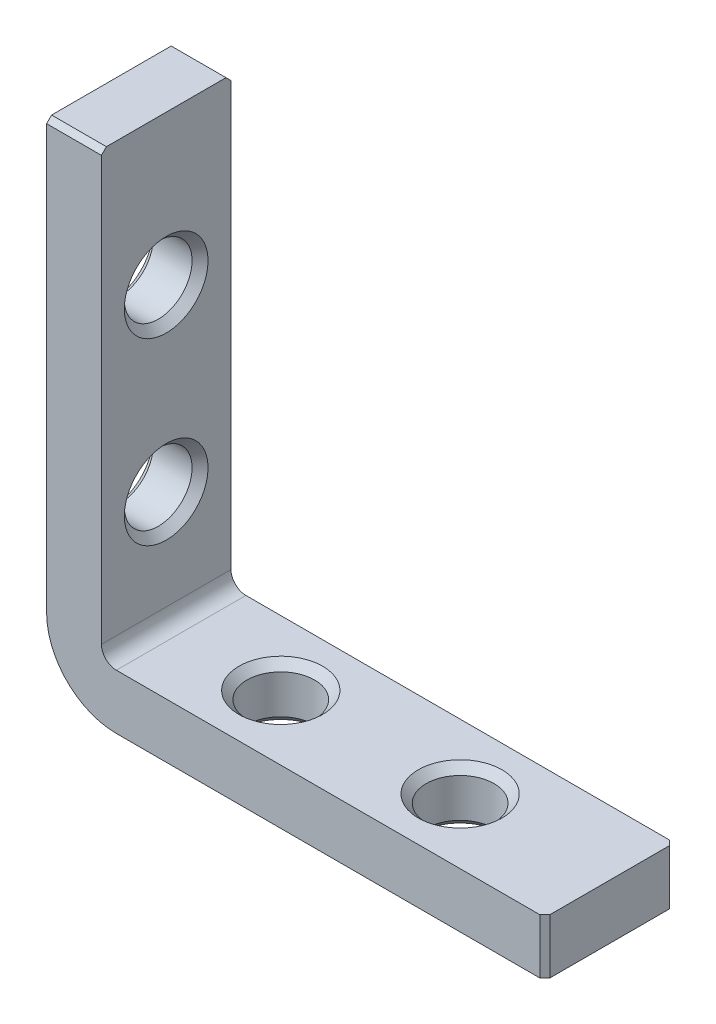
ISO-10303-21;
HEADER;
FILE_DESCRIPTION(('STEP AP214'),'2;1');
FILE_NAME('part.step','',(''),(''),'','','');
FILE_SCHEMA(('AUTOMOTIVE_DESIGN { 1 0 10303 214 1 1 1 1 }'));
ENDSEC;
DATA;
#1=APPLICATION_CONTEXT('core data for automotive mechanical design processes');
#2=APPLICATION_PROTOCOL_DEFINITION('international standard','automotive_design',2000,#1);
#3=PRODUCT_CONTEXT('',#1,'mechanical');
#4=PRODUCT('Part','Part','',(#3));
#5=PRODUCT_RELATED_PRODUCT_CATEGORY('part','',(#4));
#6=PRODUCT_DEFINITION_FORMATION('','',#4);
#7=PRODUCT_DEFINITION_CONTEXT('part definition',#1,'design');
#8=PRODUCT_DEFINITION('design','',#6,#7);
#9=PRODUCT_DEFINITION_SHAPE('','',#8);
#10=(LENGTH_UNIT() NAMED_UNIT(*) SI_UNIT(.MILLI.,.METRE.));
#11=(NAMED_UNIT(*) PLANE_ANGLE_UNIT() SI_UNIT($,.RADIAN.));
#12=(NAMED_UNIT(*) SI_UNIT($,.STERADIAN.) SOLID_ANGLE_UNIT());
#13=UNCERTAINTY_MEASURE_WITH_UNIT(LENGTH_MEASURE(1.E-05),#10,'distance_accuracy_value','');
#14=(GEOMETRIC_REPRESENTATION_CONTEXT(3) GLOBAL_UNCERTAINTY_ASSIGNED_CONTEXT((#13)) GLOBAL_UNIT_ASSIGNED_CONTEXT((#10,
#11,#12)) REPRESENTATION_CONTEXT('',''));
#15=CARTESIAN_POINT('',(0.,0.,0.));
#16=DIRECTION('',(0.,0.,1.));
#17=DIRECTION('',(1.,0.,0.));
#18=AXIS2_PLACEMENT_3D('',#15,#16,#17);
#19=CARTESIAN_POINT('',(5.50000000000001,50.,6.5));
#20=DIRECTION('',(0.,-1.,0.));
#21=DIRECTION('',(0.,0.,-1.));
#22=AXIS2_PLACEMENT_3D('',#19,#20,#21);
#23=PLANE('',#22);
#24=DIRECTION('',(0.,0.,-1.));
#25=VECTOR('',#24,1.);
#26=CARTESIAN_POINT('',(5.50000000000001,50.,6.5));
#27=LINE('',#26,#25);
#28=CARTESIAN_POINT('',(5.50000000000001,50.,6.));
#29=VERTEX_POINT('',#28);
#30=CARTESIAN_POINT('',(5.50000000000001,50.,-6.));
#31=VERTEX_POINT('',#30);
#32=EDGE_CURVE('E167',#29,#31,#27,.T.);
#33=ORIENTED_EDGE('',*,*,#32,.T.);
#34=DIRECTION('',(-1.,0.,0.));
#35=VECTOR('',#34,1.);
#36=CARTESIAN_POINT('',(5.50000000000001,50.,-6.));
#37=LINE('',#36,#35);
#38=CARTESIAN_POINT('',(0.,50.,-6.));
#39=VERTEX_POINT('',#38);
#40=EDGE_CURVE('E217',#31,#39,#37,.T.);
#41=ORIENTED_EDGE('',*,*,#40,.T.);
#42=DIRECTION('',(0.,0.,-1.));
#43=VECTOR('',#42,1.);
#44=CARTESIAN_POINT('',(0.,50.,6.5));
#45=LINE('',#44,#43);
#46=CARTESIAN_POINT('',(0.,50.,6.));
#47=VERTEX_POINT('',#46);
#48=EDGE_CURVE('E150',#47,#39,#45,.T.);
#49=ORIENTED_EDGE('',*,*,#48,.F.);
#50=DIRECTION('',(1.,0.,0.));
#51=VECTOR('',#50,1.);
#52=CARTESIAN_POINT('',(5.50000000000001,50.,6.));
#53=LINE('',#52,#51);
#54=EDGE_CURVE('E60',#47,#29,#53,.T.);
#55=ORIENTED_EDGE('',*,*,#54,.T.);
#56=EDGE_LOOP('',(#33,#41,#49,#55));
#57=FACE_BOUND('',#56,.T.);
#58=ADVANCED_FACE('F39',(#57),#23,.F.);
#59=CARTESIAN_POINT('',(0.,50.,6.5));
#60=DIRECTION('',(1.,0.,0.));
#61=DIRECTION('',(0.,0.,-1.));
#62=AXIS2_PLACEMENT_3D('',#59,#60,#61);
#63=PLANE('',#62);
#64=CARTESIAN_POINT('',(0.,35.,0.));
#65=DIRECTION('',(-1.,0.,0.));
#66=DIRECTION('',(0.,0.,1.));
#67=AXIS2_PLACEMENT_3D('',#64,#65,#66);
#68=CIRCLE('',#67,4.2);
#69=CARTESIAN_POINT('',(0.,35.,4.2));
#70=VERTEX_POINT('',#69);
#71=EDGE_CURVE('E529',#70,#70,#68,.T.);
#72=ORIENTED_EDGE('',*,*,#71,.F.);
#73=EDGE_LOOP('',(#72));
#74=FACE_BOUND('',#73,.T.);
#75=CARTESIAN_POINT('',(0.,17.,0.));
#76=DIRECTION('',(-1.,0.,0.));
#77=DIRECTION('',(0.,0.,1.));
#78=AXIS2_PLACEMENT_3D('',#75,#76,#77);
#79=CIRCLE('',#78,4.2);
#80=CARTESIAN_POINT('',(0.,17.,4.2));
#81=VERTEX_POINT('',#80);
#82=EDGE_CURVE('E517',#81,#81,#79,.T.);
#83=ORIENTED_EDGE('',*,*,#82,.F.);
#84=EDGE_LOOP('',(#83));
#85=FACE_BOUND('',#84,.T.);
#86=ORIENTED_EDGE('',*,*,#48,.T.);
#87=DIRECTION('',(0.,0.707106781186543,0.707106781186552));
#88=VECTOR('',#87,1.);
#89=CARTESIAN_POINT('',(0.,50.,-6.));
#90=LINE('',#89,#88);
#91=CARTESIAN_POINT('',(0.,49.5,-6.5));
#92=VERTEX_POINT('',#91);
#93=EDGE_CURVE('E222',#39,#92,#90,.F.);
#94=ORIENTED_EDGE('',*,*,#93,.T.);
#95=DIRECTION('',(0.,-1.,0.));
#96=VECTOR('',#95,1.);
#97=CARTESIAN_POINT('',(0.,50.,-6.5));
#98=LINE('',#97,#96);
#99=CARTESIAN_POINT('',(0.,7.00000000000005,-6.5));
#100=VERTEX_POINT('',#99);
#101=EDGE_CURVE('E147',#92,#100,#98,.T.);
#102=ORIENTED_EDGE('',*,*,#101,.T.);
#103=DIRECTION('',(0.,0.,-1.));
#104=VECTOR('',#103,1.);
#105=CARTESIAN_POINT('',(0.,7.00000000000005,6.5));
#106=LINE('',#105,#104);
#107=CARTESIAN_POINT('',(0.,7.00000000000005,6.5));
#108=VERTEX_POINT('',#107);
#109=EDGE_CURVE('E143',#108,#100,#106,.T.);
#110=ORIENTED_EDGE('',*,*,#109,.F.);
#111=DIRECTION('',(0.,-1.,0.));
#112=VECTOR('',#111,1.);
#113=CARTESIAN_POINT('',(0.,50.,6.5));
#114=LINE('',#113,#112);
#115=CARTESIAN_POINT('',(0.,49.5,6.5));
#116=VERTEX_POINT('',#115);
#117=EDGE_CURVE('E129',#116,#108,#114,.T.);
#118=ORIENTED_EDGE('',*,*,#117,.F.);
#119=DIRECTION('',(0.,0.707106781186543,-0.707106781186552));
#120=VECTOR('',#119,1.);
#121=CARTESIAN_POINT('',(0.,49.5,6.5));
#122=LINE('',#121,#120);
#123=EDGE_CURVE('E220',#116,#47,#122,.T.);
#124=ORIENTED_EDGE('',*,*,#123,.T.);
#125=EDGE_LOOP('',(#86,#94,#102,#110,#118,#124));
#126=FACE_BOUND('',#125,.T.);
#127=ADVANCED_FACE('F145',(#74,#85,#126),#63,.F.);
#128=CARTESIAN_POINT('',(7.,7.,6.5));
#129=DIRECTION('',(0.,0.,-1.));
#130=DIRECTION('',(-1.,0.,0.));
#131=AXIS2_PLACEMENT_3D('',#128,#129,#130);
#132=CYLINDRICAL_SURFACE('',#131,7.);
#133=CARTESIAN_POINT('',(7.,7.,-6.5));
#134=DIRECTION('',(0.,0.,1.));
#135=DIRECTION('',(1.,0.,0.));
#136=AXIS2_PLACEMENT_3D('',#133,#134,#135);
#137=CIRCLE('',#136,7.);
#138=CARTESIAN_POINT('',(7.00000000000005,0.,-6.5));
#139=VERTEX_POINT('',#138);
#140=EDGE_CURVE('E169',#100,#139,#137,.T.);
#141=ORIENTED_EDGE('',*,*,#140,.T.);
#142=DIRECTION('',(0.,0.,-1.));
#143=VECTOR('',#142,1.);
#144=CARTESIAN_POINT('',(7.00000000000005,0.,6.5));
#145=LINE('',#144,#143);
#146=CARTESIAN_POINT('',(7.00000000000005,0.,6.5));
#147=VERTEX_POINT('',#146);
#148=EDGE_CURVE('E151',#147,#139,#145,.T.);
#149=ORIENTED_EDGE('',*,*,#148,.F.);
#150=CARTESIAN_POINT('',(7.,7.,6.5));
#151=DIRECTION('',(0.,0.,1.));
#152=DIRECTION('',(1.,0.,0.));
#153=AXIS2_PLACEMENT_3D('',#150,#151,#152);
#154=CIRCLE('',#153,7.);
#155=EDGE_CURVE('E134',#108,#147,#154,.T.);
#156=ORIENTED_EDGE('',*,*,#155,.F.);
#157=ORIENTED_EDGE('',*,*,#109,.T.);
#158=EDGE_LOOP('',(#141,#149,#156,#157));
#159=FACE_BOUND('',#158,.T.);
#160=ADVANCED_FACE('F153',(#159),#132,.T.);
#161=CARTESIAN_POINT('',(7.00000000000005,0.,6.5));
#162=DIRECTION('',(0.,1.,0.));
#163=DIRECTION('',(0.,0.,1.));
#164=AXIS2_PLACEMENT_3D('',#161,#162,#163);
#165=PLANE('',#164);
#166=CARTESIAN_POINT('',(35.,0.,0.));
#167=DIRECTION('',(0.,-1.,0.));
#168=DIRECTION('',(0.,0.,-1.));
#169=AXIS2_PLACEMENT_3D('',#166,#167,#168);
#170=CIRCLE('',#169,4.2);
#171=CARTESIAN_POINT('',(35.,0.,-4.2));
#172=VERTEX_POINT('',#171);
#173=EDGE_CURVE('E553',#172,#172,#170,.T.);
#174=ORIENTED_EDGE('',*,*,#173,.F.);
#175=EDGE_LOOP('',(#174));
#176=FACE_BOUND('',#175,.T.);
#177=CARTESIAN_POINT('',(17.,0.,0.));
#178=DIRECTION('',(0.,-1.,0.));
#179=DIRECTION('',(0.,0.,-1.));
#180=AXIS2_PLACEMENT_3D('',#177,#178,#179);
#181=CIRCLE('',#180,4.2);
#182=CARTESIAN_POINT('',(17.,0.,-4.2));
#183=VERTEX_POINT('',#182);
#184=EDGE_CURVE('E541',#183,#183,#181,.T.);
#185=ORIENTED_EDGE('',*,*,#184,.F.);
#186=EDGE_LOOP('',(#185));
#187=FACE_BOUND('',#186,.T.);
#188=DIRECTION('',(1.,0.,0.));
#189=VECTOR('',#188,1.);
#190=CARTESIAN_POINT('',(7.00000000000005,0.,-6.5));
#191=LINE('',#190,#189);
#192=CARTESIAN_POINT('',(49.5,0.,-6.5));
#193=VERTEX_POINT('',#192);
#194=EDGE_CURVE('E172',#139,#193,#191,.T.);
#195=ORIENTED_EDGE('',*,*,#194,.T.);
#196=DIRECTION('',(-0.707106781186543,0.,-0.707106781186552));
#197=VECTOR('',#196,1.);
#198=CARTESIAN_POINT('',(50.,0.,-6.));
#199=LINE('',#198,#197);
#200=CARTESIAN_POINT('',(50.,0.,-6.));
#201=VERTEX_POINT('',#200);
#202=EDGE_CURVE('E210',#193,#201,#199,.F.);
#203=ORIENTED_EDGE('',*,*,#202,.T.);
#204=DIRECTION('',(0.,0.,-1.));
#205=VECTOR('',#204,1.);
#206=CARTESIAN_POINT('',(50.,0.,6.5));
#207=LINE('',#206,#205);
#208=CARTESIAN_POINT('',(50.,0.,6.));
#209=VERTEX_POINT('',#208);
#210=EDGE_CURVE('E190',#209,#201,#207,.T.);
#211=ORIENTED_EDGE('',*,*,#210,.F.);
#212=DIRECTION('',(-0.707106781186543,0.,0.707106781186552));
#213=VECTOR('',#212,1.);
#214=CARTESIAN_POINT('',(49.5,0.,6.5));
#215=LINE('',#214,#213);
#216=CARTESIAN_POINT('',(49.5,0.,6.5));
#217=VERTEX_POINT('',#216);
#218=EDGE_CURVE('E208',#209,#217,#215,.T.);
#219=ORIENTED_EDGE('',*,*,#218,.T.);
#220=DIRECTION('',(1.,0.,0.));
#221=VECTOR('',#220,1.);
#222=CARTESIAN_POINT('',(7.00000000000005,0.,6.5));
#223=LINE('',#222,#221);
#224=EDGE_CURVE('E156',#147,#217,#223,.T.);
#225=ORIENTED_EDGE('',*,*,#224,.F.);
#226=ORIENTED_EDGE('',*,*,#148,.T.);
#227=EDGE_LOOP('',(#195,#203,#211,#219,#225,#226));
#228=FACE_BOUND('',#227,.T.);
#229=ADVANCED_FACE('F239',(#176,#187,#228),#165,.F.);
#230=CARTESIAN_POINT('',(50.,5.50000000000001,6.5));
#231=DIRECTION('',(-1.,0.,0.));
#232=DIRECTION('',(0.,0.,1.));
#233=AXIS2_PLACEMENT_3D('',#230,#231,#232);
#234=PLANE('',#233);
#235=ORIENTED_EDGE('',*,*,#210,.T.);
#236=DIRECTION('',(0.,1.,0.));
#237=VECTOR('',#236,1.);
#238=CARTESIAN_POINT('',(50.,5.50000000000001,-6.));
#239=LINE('',#238,#237);
#240=CARTESIAN_POINT('',(50.,5.50000000000001,-6.));
#241=VERTEX_POINT('',#240);
#242=EDGE_CURVE('E197',#201,#241,#239,.T.);
#243=ORIENTED_EDGE('',*,*,#242,.T.);
#244=DIRECTION('',(0.,0.,-1.));
#245=VECTOR('',#244,1.);
#246=CARTESIAN_POINT('',(50.,5.50000000000001,6.5));
#247=LINE('',#246,#245);
#248=CARTESIAN_POINT('',(50.,5.50000000000001,6.));
#249=VERTEX_POINT('',#248);
#250=EDGE_CURVE('E187',#249,#241,#247,.T.);
#251=ORIENTED_EDGE('',*,*,#250,.F.);
#252=DIRECTION('',(0.,-1.,0.));
#253=VECTOR('',#252,1.);
#254=CARTESIAN_POINT('',(50.,0.,6.));
#255=LINE('',#254,#253);
#256=EDGE_CURVE('E195',#249,#209,#255,.T.);
#257=ORIENTED_EDGE('',*,*,#256,.T.);
#258=EDGE_LOOP('',(#235,#243,#251,#257));
#259=FACE_BOUND('',#258,.T.);
#260=ADVANCED_FACE('F253',(#259),#234,.F.);
#261=CARTESIAN_POINT('',(50.,5.50000000000001,6.5));
#262=DIRECTION('',(0.,-1.,0.));
#263=DIRECTION('',(1.,0.,0.));
#264=AXIS2_PLACEMENT_3D('',#261,#262,#263);
#265=PLANE('',#264);
#266=CARTESIAN_POINT('',(35.,5.49999999999999,0.));
#267=DIRECTION('',(0.,-1.,0.));
#268=DIRECTION('',(0.,0.,-1.));
#269=AXIS2_PLACEMENT_3D('',#266,#267,#268);
#270=CIRCLE('',#269,4.2);
#271=CARTESIAN_POINT('',(35.,5.49999999999999,-4.2));
#272=VERTEX_POINT('',#271);
#273=EDGE_CURVE('E556',#272,#272,#270,.T.);
#274=ORIENTED_EDGE('',*,*,#273,.T.);
#275=EDGE_LOOP('',(#274));
#276=FACE_BOUND('',#275,.T.);
#277=CARTESIAN_POINT('',(17.,5.49999999999999,0.));
#278=DIRECTION('',(0.,-1.,0.));
#279=DIRECTION('',(0.,0.,-1.));
#280=AXIS2_PLACEMENT_3D('',#277,#278,#279);
#281=CIRCLE('',#280,4.2);
#282=CARTESIAN_POINT('',(17.,5.49999999999999,-4.2));
#283=VERTEX_POINT('',#282);
#284=EDGE_CURVE('E544',#283,#283,#281,.T.);
#285=ORIENTED_EDGE('',*,*,#284,.T.);
#286=EDGE_LOOP('',(#285));
#287=FACE_BOUND('',#286,.T.);
#288=ORIENTED_EDGE('',*,*,#250,.T.);
#289=DIRECTION('',(0.707106781186543,0.,0.707106781186552));
#290=VECTOR('',#289,1.);
#291=CARTESIAN_POINT('',(50.,5.50000000000001,-6.));
#292=LINE('',#291,#290);
#293=CARTESIAN_POINT('',(49.5,5.50000000000001,-6.5));
#294=VERTEX_POINT('',#293);
#295=EDGE_CURVE('E202',#241,#294,#292,.F.);
#296=ORIENTED_EDGE('',*,*,#295,.T.);
#297=DIRECTION('',(-1.,0.,0.));
#298=VECTOR('',#297,1.);
#299=CARTESIAN_POINT('',(50.,5.50000000000001,-6.5));
#300=LINE('',#299,#298);
#301=CARTESIAN_POINT('',(7.00000000000002,5.5,-6.5));
#302=VERTEX_POINT('',#301);
#303=EDGE_CURVE('E175',#294,#302,#300,.T.);
#304=ORIENTED_EDGE('',*,*,#303,.T.);
#305=DIRECTION('',(0.,0.,-1.));
#306=VECTOR('',#305,1.);
#307=CARTESIAN_POINT('',(7.00000000000002,5.5,6.5));
#308=LINE('',#307,#306);
#309=CARTESIAN_POINT('',(7.00000000000002,5.5,6.5));
#310=VERTEX_POINT('',#309);
#311=EDGE_CURVE('E184',#310,#302,#308,.T.);
#312=ORIENTED_EDGE('',*,*,#311,.F.);
#313=DIRECTION('',(-1.,0.,0.));
#314=VECTOR('',#313,1.);
#315=CARTESIAN_POINT('',(50.,5.50000000000001,6.5));
#316=LINE('',#315,#314);
#317=CARTESIAN_POINT('',(49.5,5.50000000000001,6.5));
#318=VERTEX_POINT('',#317);
#319=EDGE_CURVE('E158',#318,#310,#316,.T.);
#320=ORIENTED_EDGE('',*,*,#319,.F.);
#321=DIRECTION('',(0.707106781186543,0.,-0.707106781186552));
#322=VECTOR('',#321,1.);
#323=CARTESIAN_POINT('',(49.5,5.50000000000001,6.5));
#324=LINE('',#323,#322);
#325=EDGE_CURVE('E200',#318,#249,#324,.T.);
#326=ORIENTED_EDGE('',*,*,#325,.T.);
#327=EDGE_LOOP('',(#288,#296,#304,#312,#320,#326));
#328=FACE_BOUND('',#327,.T.);
#329=ADVANCED_FACE('F250',(#276,#287,#328),#265,.F.);
#330=CARTESIAN_POINT('',(7.,7.,6.5));
#331=DIRECTION('',(0.,0.,-1.));
#332=DIRECTION('',(-1.,0.,0.));
#333=AXIS2_PLACEMENT_3D('',#330,#331,#332);
#334=CYLINDRICAL_SURFACE('',#333,1.5);
#335=CARTESIAN_POINT('',(7.,7.,-6.5));
#336=DIRECTION('',(0.,0.,-1.));
#337=DIRECTION('',(-1.,0.,0.));
#338=AXIS2_PLACEMENT_3D('',#335,#336,#337);
#339=CIRCLE('',#338,1.5);
#340=CARTESIAN_POINT('',(5.50000000000001,7.,-6.5));
#341=VERTEX_POINT('',#340);
#342=EDGE_CURVE('E177',#302,#341,#339,.T.);
#343=ORIENTED_EDGE('',*,*,#342,.T.);
#344=DIRECTION('',(0.,0.,-1.));
#345=VECTOR('',#344,1.);
#346=CARTESIAN_POINT('',(5.50000000000001,7.,6.5));
#347=LINE('',#346,#345);
#348=CARTESIAN_POINT('',(5.50000000000001,7.,6.5));
#349=VERTEX_POINT('',#348);
#350=EDGE_CURVE('E181',#349,#341,#347,.T.);
#351=ORIENTED_EDGE('',*,*,#350,.F.);
#352=CARTESIAN_POINT('',(7.,7.,6.5));
#353=DIRECTION('',(0.,0.,-1.));
#354=DIRECTION('',(-1.,0.,0.));
#355=AXIS2_PLACEMENT_3D('',#352,#353,#354);
#356=CIRCLE('',#355,1.5);
#357=EDGE_CURVE('E163',#310,#349,#356,.T.);
#358=ORIENTED_EDGE('',*,*,#357,.F.);
#359=ORIENTED_EDGE('',*,*,#311,.T.);
#360=EDGE_LOOP('',(#343,#351,#358,#359));
#361=FACE_BOUND('',#360,.T.);
#362=ADVANCED_FACE('F260',(#361),#334,.F.);
#363=CARTESIAN_POINT('',(5.50000000000001,7.00000000000001,6.5));
#364=DIRECTION('',(-1.,0.,0.));
#365=DIRECTION('',(0.,0.,1.));
#366=AXIS2_PLACEMENT_3D('',#363,#364,#365);
#367=PLANE('',#366);
#368=CARTESIAN_POINT('',(5.5,35.,0.));
#369=DIRECTION('',(-1.,0.,0.));
#370=DIRECTION('',(0.,0.,1.));
#371=AXIS2_PLACEMENT_3D('',#368,#369,#370);
#372=CIRCLE('',#371,4.2);
#373=CARTESIAN_POINT('',(5.5,35.,4.2));
#374=VERTEX_POINT('',#373);
#375=EDGE_CURVE('E532',#374,#374,#372,.T.);
#376=ORIENTED_EDGE('',*,*,#375,.T.);
#377=EDGE_LOOP('',(#376));
#378=FACE_BOUND('',#377,.T.);
#379=CARTESIAN_POINT('',(5.5,17.,0.));
#380=DIRECTION('',(-1.,0.,0.));
#381=DIRECTION('',(0.,0.,1.));
#382=AXIS2_PLACEMENT_3D('',#379,#380,#381);
#383=CIRCLE('',#382,4.2);
#384=CARTESIAN_POINT('',(5.5,17.,4.2));
#385=VERTEX_POINT('',#384);
#386=EDGE_CURVE('E512',#385,#385,#383,.T.);
#387=ORIENTED_EDGE('',*,*,#386,.T.);
#388=EDGE_LOOP('',(#387));
#389=FACE_BOUND('',#388,.T.);
#390=DIRECTION('',(0.,1.,0.));
#391=VECTOR('',#390,1.);
#392=CARTESIAN_POINT('',(5.50000000000001,7.00000000000001,-6.5));
#393=LINE('',#392,#391);
#394=CARTESIAN_POINT('',(5.50000000000001,49.5,-6.5));
#395=VERTEX_POINT('',#394);
#396=EDGE_CURVE('E140',#341,#395,#393,.T.);
#397=ORIENTED_EDGE('',*,*,#396,.T.);
#398=DIRECTION('',(0.,-0.707106781186543,-0.707106781186552));
#399=VECTOR('',#398,1.);
#400=CARTESIAN_POINT('',(5.50000000000001,50.,-6.));
#401=LINE('',#400,#399);
#402=EDGE_CURVE('E11',#395,#31,#401,.F.);
#403=ORIENTED_EDGE('',*,*,#402,.T.);
#404=ORIENTED_EDGE('',*,*,#32,.F.);
#405=DIRECTION('',(0.,-0.707106781186543,0.707106781186552));
#406=VECTOR('',#405,1.);
#407=CARTESIAN_POINT('',(5.50000000000001,49.5,6.5));
#408=LINE('',#407,#406);
#409=CARTESIAN_POINT('',(5.50000000000001,49.5,6.5));
#410=VERTEX_POINT('',#409);
#411=EDGE_CURVE('E48',#29,#410,#408,.T.);
#412=ORIENTED_EDGE('',*,*,#411,.T.);
#413=DIRECTION('',(0.,1.,0.));
#414=VECTOR('',#413,1.);
#415=CARTESIAN_POINT('',(5.50000000000001,7.00000000000001,6.5));
#416=LINE('',#415,#414);
#417=EDGE_CURVE('E165',#349,#410,#416,.T.);
#418=ORIENTED_EDGE('',*,*,#417,.F.);
#419=ORIENTED_EDGE('',*,*,#350,.T.);
#420=EDGE_LOOP('',(#397,#403,#404,#412,#418,#419));
#421=FACE_BOUND('',#420,.T.);
#422=ADVANCED_FACE('F225',(#378,#389,#421),#367,.F.);
#423=CARTESIAN_POINT('',(7.,7.,6.5));
#424=DIRECTION('',(0.,0.,1.));
#425=DIRECTION('',(1.,0.,0.));
#426=AXIS2_PLACEMENT_3D('',#423,#424,#425);
#427=PLANE('',#426);
#428=ORIENTED_EDGE('',*,*,#224,.T.);
#429=DIRECTION('',(0.,1.,0.));
#430=VECTOR('',#429,1.);
#431=CARTESIAN_POINT('',(49.5,5.50000000000001,6.5));
#432=LINE('',#431,#430);
#433=EDGE_CURVE('E213',#217,#318,#432,.T.);
#434=ORIENTED_EDGE('',*,*,#433,.T.);
#435=ORIENTED_EDGE('',*,*,#319,.T.);
#436=ORIENTED_EDGE('',*,*,#357,.T.);
#437=ORIENTED_EDGE('',*,*,#417,.T.);
#438=DIRECTION('',(-1.,0.,0.));
#439=VECTOR('',#438,1.);
#440=CARTESIAN_POINT('',(0.,49.5,6.5));
#441=LINE('',#440,#439);
#442=EDGE_CURVE('E138',#410,#116,#441,.T.);
#443=ORIENTED_EDGE('',*,*,#442,.T.);
#444=ORIENTED_EDGE('',*,*,#117,.T.);
#445=ORIENTED_EDGE('',*,*,#155,.T.);
#446=EDGE_LOOP('',(#428,#434,#435,#436,#437,#443,#444,#445));
#447=FACE_BOUND('',#446,.T.);
#448=ADVANCED_FACE('F132',(#447),#427,.T.);
#449=CARTESIAN_POINT('',(7.,7.,-6.5));
#450=DIRECTION('',(0.,0.,1.));
#451=DIRECTION('',(1.,0.,0.));
#452=AXIS2_PLACEMENT_3D('',#449,#450,#451);
#453=PLANE('',#452);
#454=ORIENTED_EDGE('',*,*,#303,.F.);
#455=DIRECTION('',(0.,-1.,0.));
#456=VECTOR('',#455,1.);
#457=CARTESIAN_POINT('',(49.5,7.,-6.5));
#458=LINE('',#457,#456);
#459=EDGE_CURVE('E206',#294,#193,#458,.T.);
#460=ORIENTED_EDGE('',*,*,#459,.T.);
#461=ORIENTED_EDGE('',*,*,#194,.F.);
#462=ORIENTED_EDGE('',*,*,#140,.F.);
#463=ORIENTED_EDGE('',*,*,#101,.F.);
#464=DIRECTION('',(1.,0.,0.));
#465=VECTOR('',#464,1.);
#466=CARTESIAN_POINT('',(7.,49.5,-6.5));
#467=LINE('',#466,#465);
#468=EDGE_CURVE('E204',#92,#395,#467,.T.);
#469=ORIENTED_EDGE('',*,*,#468,.T.);
#470=ORIENTED_EDGE('',*,*,#396,.F.);
#471=ORIENTED_EDGE('',*,*,#342,.F.);
#472=EDGE_LOOP('',(#454,#460,#461,#462,#463,#469,#470,#471));
#473=FACE_BOUND('',#472,.T.);
#474=ADVANCED_FACE('F235',(#473),#453,.F.);
#475=CARTESIAN_POINT('',(4.7,17.,0.));
#476=DIRECTION('',(1.,0.,0.));
#477=DIRECTION('',(0.,0.,-1.));
#478=AXIS2_PLACEMENT_3D('',#475,#476,#477);
#479=CONICAL_SURFACE('',#478,3.4,0.785398163397445);
#480=ORIENTED_EDGE('',*,*,#386,.F.);
#481=EDGE_LOOP('',(#480));
#482=FACE_BOUND('',#481,.T.);
#483=CARTESIAN_POINT('',(4.7,17.,0.));
#484=DIRECTION('',(-1.,0.,0.));
#485=DIRECTION('',(0.,0.,1.));
#486=AXIS2_PLACEMENT_3D('',#483,#484,#485);
#487=CIRCLE('',#486,3.4);
#488=CARTESIAN_POINT('',(4.7,17.,3.4));
#489=VERTEX_POINT('',#488);
#490=EDGE_CURVE('E170',#489,#489,#487,.T.);
#491=ORIENTED_EDGE('',*,*,#490,.T.);
#492=EDGE_LOOP('',(#491));
#493=FACE_BOUND('',#492,.T.);
#494=ADVANCED_FACE('F326',(#482,#493),#479,.F.);
#495=CARTESIAN_POINT('',(0.,17.,0.));
#496=DIRECTION('',(-1.,0.,0.));
#497=DIRECTION('',(0.,0.,1.));
#498=AXIS2_PLACEMENT_3D('',#495,#496,#497);
#499=CYLINDRICAL_SURFACE('',#498,3.4);
#500=ORIENTED_EDGE('',*,*,#490,.F.);
#501=EDGE_LOOP('',(#500));
#502=FACE_BOUND('',#501,.T.);
#503=CARTESIAN_POINT('',(0.8,17.,0.));
#504=DIRECTION('',(-1.,0.,0.));
#505=DIRECTION('',(0.,0.,1.));
#506=AXIS2_PLACEMENT_3D('',#503,#504,#505);
#507=CIRCLE('',#506,3.4);
#508=CARTESIAN_POINT('',(0.8,17.,3.4));
#509=VERTEX_POINT('',#508);
#510=EDGE_CURVE('E515',#509,#509,#507,.T.);
#511=ORIENTED_EDGE('',*,*,#510,.T.);
#512=EDGE_LOOP('',(#511));
#513=FACE_BOUND('',#512,.T.);
#514=ADVANCED_FACE('F479',(#502,#513),#499,.F.);
#515=CARTESIAN_POINT('',(0.,17.,0.));
#516=DIRECTION('',(-1.,0.,0.));
#517=DIRECTION('',(0.,0.,1.));
#518=AXIS2_PLACEMENT_3D('',#515,#516,#517);
#519=CONICAL_SURFACE('',#518,4.2,0.785398163397447);
#520=ORIENTED_EDGE('',*,*,#510,.F.);
#521=EDGE_LOOP('',(#520));
#522=FACE_BOUND('',#521,.T.);
#523=ORIENTED_EDGE('',*,*,#82,.T.);
#524=EDGE_LOOP('',(#523));
#525=FACE_BOUND('',#524,.T.);
#526=ADVANCED_FACE('F469',(#522,#525),#519,.F.);
#527=CARTESIAN_POINT('',(4.7,35.,0.));
#528=DIRECTION('',(1.,0.,0.));
#529=DIRECTION('',(0.,0.,-1.));
#530=AXIS2_PLACEMENT_3D('',#527,#528,#529);
#531=CONICAL_SURFACE('',#530,3.4,0.785398163397447);
#532=ORIENTED_EDGE('',*,*,#375,.F.);
#533=EDGE_LOOP('',(#532));
#534=FACE_BOUND('',#533,.T.);
#535=CARTESIAN_POINT('',(4.7,35.,0.));
#536=DIRECTION('',(-1.,0.,0.));
#537=DIRECTION('',(0.,0.,1.));
#538=AXIS2_PLACEMENT_3D('',#535,#536,#537);
#539=CIRCLE('',#538,3.4);
#540=CARTESIAN_POINT('',(4.7,35.,3.4));
#541=VERTEX_POINT('',#540);
#542=EDGE_CURVE('E523',#541,#541,#539,.T.);
#543=ORIENTED_EDGE('',*,*,#542,.T.);
#544=EDGE_LOOP('',(#543));
#545=FACE_BOUND('',#544,.T.);
#546=ADVANCED_FACE('F459',(#534,#545),#531,.F.);
#547=CARTESIAN_POINT('',(0.,35.,0.));
#548=DIRECTION('',(-1.,0.,0.));
#549=DIRECTION('',(0.,0.,1.));
#550=AXIS2_PLACEMENT_3D('',#547,#548,#549);
#551=CYLINDRICAL_SURFACE('',#550,3.4);
#552=ORIENTED_EDGE('',*,*,#542,.F.);
#553=EDGE_LOOP('',(#552));
#554=FACE_BOUND('',#553,.T.);
#555=CARTESIAN_POINT('',(0.8,35.,0.));
#556=DIRECTION('',(-1.,0.,0.));
#557=DIRECTION('',(0.,0.,1.));
#558=AXIS2_PLACEMENT_3D('',#555,#556,#557);
#559=CIRCLE('',#558,3.4);
#560=CARTESIAN_POINT('',(0.8,35.,3.4));
#561=VERTEX_POINT('',#560);
#562=EDGE_CURVE('E526',#561,#561,#559,.T.);
#563=ORIENTED_EDGE('',*,*,#562,.T.);
#564=EDGE_LOOP('',(#563));
#565=FACE_BOUND('',#564,.T.);
#566=ADVANCED_FACE('F448',(#554,#565),#551,.F.);
#567=CARTESIAN_POINT('',(0.,35.,0.));
#568=DIRECTION('',(-1.,0.,0.));
#569=DIRECTION('',(0.,0.,1.));
#570=AXIS2_PLACEMENT_3D('',#567,#568,#569);
#571=CONICAL_SURFACE('',#570,4.2,0.785398163397449);
#572=ORIENTED_EDGE('',*,*,#562,.F.);
#573=EDGE_LOOP('',(#572));
#574=FACE_BOUND('',#573,.T.);
#575=ORIENTED_EDGE('',*,*,#71,.T.);
#576=EDGE_LOOP('',(#575));
#577=FACE_BOUND('',#576,.T.);
#578=ADVANCED_FACE('F438',(#574,#577),#571,.F.);
#579=CARTESIAN_POINT('',(17.,4.69999999999999,0.));
#580=DIRECTION('',(0.,1.,0.));
#581=DIRECTION('',(0.,0.,1.));
#582=AXIS2_PLACEMENT_3D('',#579,#580,#581);
#583=CONICAL_SURFACE('',#582,3.4,0.785398163397445);
#584=ORIENTED_EDGE('',*,*,#284,.F.);
#585=EDGE_LOOP('',(#584));
#586=FACE_BOUND('',#585,.T.);
#587=CARTESIAN_POINT('',(17.,4.69999999999999,0.));
#588=DIRECTION('',(0.,-1.,0.));
#589=DIRECTION('',(0.,0.,-1.));
#590=AXIS2_PLACEMENT_3D('',#587,#588,#589);
#591=CIRCLE('',#590,3.4);
#592=CARTESIAN_POINT('',(17.,4.69999999999999,-3.4));
#593=VERTEX_POINT('',#592);
#594=EDGE_CURVE('E535',#593,#593,#591,.T.);
#595=ORIENTED_EDGE('',*,*,#594,.T.);
#596=EDGE_LOOP('',(#595));
#597=FACE_BOUND('',#596,.T.);
#598=ADVANCED_FACE('F427',(#586,#597),#583,.F.);
#599=CARTESIAN_POINT('',(17.,0.,0.));
#600=DIRECTION('',(0.,-1.,0.));
#601=DIRECTION('',(0.,0.,-1.));
#602=AXIS2_PLACEMENT_3D('',#599,#600,#601);
#603=CYLINDRICAL_SURFACE('',#602,3.4);
#604=ORIENTED_EDGE('',*,*,#594,.F.);
#605=EDGE_LOOP('',(#604));
#606=FACE_BOUND('',#605,.T.);
#607=CARTESIAN_POINT('',(17.,0.799999999999993,0.));
#608=DIRECTION('',(0.,-1.,0.));
#609=DIRECTION('',(0.,0.,-1.));
#610=AXIS2_PLACEMENT_3D('',#607,#608,#609);
#611=CIRCLE('',#610,3.4);
#612=CARTESIAN_POINT('',(17.,0.799999999999993,-3.4));
#613=VERTEX_POINT('',#612);
#614=EDGE_CURVE('E538',#613,#613,#611,.T.);
#615=ORIENTED_EDGE('',*,*,#614,.T.);
#616=EDGE_LOOP('',(#615));
#617=FACE_BOUND('',#616,.T.);
#618=ADVANCED_FACE('F417',(#606,#617),#603,.F.);
#619=CARTESIAN_POINT('',(17.,0.,0.));
#620=DIRECTION('',(0.,-1.,0.));
#621=DIRECTION('',(0.,0.,-1.));
#622=AXIS2_PLACEMENT_3D('',#619,#620,#621);
#623=CONICAL_SURFACE('',#622,4.2,0.785398163397447);
#624=ORIENTED_EDGE('',*,*,#614,.F.);
#625=EDGE_LOOP('',(#624));
#626=FACE_BOUND('',#625,.T.);
#627=ORIENTED_EDGE('',*,*,#184,.T.);
#628=EDGE_LOOP('',(#627));
#629=FACE_BOUND('',#628,.T.);
#630=ADVANCED_FACE('F407',(#626,#629),#623,.F.);
#631=CARTESIAN_POINT('',(35.,4.69999999999998,0.));
#632=DIRECTION('',(0.,1.,0.));
#633=DIRECTION('',(0.,0.,1.));
#634=AXIS2_PLACEMENT_3D('',#631,#632,#633);
#635=CONICAL_SURFACE('',#634,3.4,0.785398163397447);
#636=ORIENTED_EDGE('',*,*,#273,.F.);
#637=EDGE_LOOP('',(#636));
#638=FACE_BOUND('',#637,.T.);
#639=CARTESIAN_POINT('',(35.,4.69999999999998,0.));
#640=DIRECTION('',(0.,-1.,0.));
#641=DIRECTION('',(0.,0.,-1.));
#642=AXIS2_PLACEMENT_3D('',#639,#640,#641);
#643=CIRCLE('',#642,3.4);
#644=CARTESIAN_POINT('',(35.,4.69999999999998,-3.4));
#645=VERTEX_POINT('',#644);
#646=EDGE_CURVE('E547',#645,#645,#643,.T.);
#647=ORIENTED_EDGE('',*,*,#646,.T.);
#648=EDGE_LOOP('',(#647));
#649=FACE_BOUND('',#648,.T.);
#650=ADVANCED_FACE('F396',(#638,#649),#635,.F.);
#651=CARTESIAN_POINT('',(35.,0.,0.));
#652=DIRECTION('',(0.,-1.,0.));
#653=DIRECTION('',(0.,0.,-1.));
#654=AXIS2_PLACEMENT_3D('',#651,#652,#653);
#655=CYLINDRICAL_SURFACE('',#654,3.4);
#656=ORIENTED_EDGE('',*,*,#646,.F.);
#657=EDGE_LOOP('',(#656));
#658=FACE_BOUND('',#657,.T.);
#659=CARTESIAN_POINT('',(35.,0.799999999999985,0.));
#660=DIRECTION('',(0.,-1.,0.));
#661=DIRECTION('',(0.,0.,-1.));
#662=AXIS2_PLACEMENT_3D('',#659,#660,#661);
#663=CIRCLE('',#662,3.4);
#664=CARTESIAN_POINT('',(35.,0.799999999999985,-3.4));
#665=VERTEX_POINT('',#664);
#666=EDGE_CURVE('E550',#665,#665,#663,.T.);
#667=ORIENTED_EDGE('',*,*,#666,.T.);
#668=EDGE_LOOP('',(#667));
#669=FACE_BOUND('',#668,.T.);
#670=ADVANCED_FACE('F385',(#658,#669),#655,.F.);
#671=CARTESIAN_POINT('',(35.,0.,0.));
#672=DIRECTION('',(0.,-1.,0.));
#673=DIRECTION('',(0.,0.,-1.));
#674=AXIS2_PLACEMENT_3D('',#671,#672,#673);
#675=CONICAL_SURFACE('',#674,4.2,0.785398163397449);
#676=ORIENTED_EDGE('',*,*,#666,.F.);
#677=EDGE_LOOP('',(#676));
#678=FACE_BOUND('',#677,.T.);
#679=ORIENTED_EDGE('',*,*,#173,.T.);
#680=EDGE_LOOP('',(#679));
#681=FACE_BOUND('',#680,.T.);
#682=ADVANCED_FACE('F286',(#678,#681),#675,.F.);
#683=CARTESIAN_POINT('',(50.,5.50000000000001,-6.));
#684=DIRECTION('',(-0.707106781186552,0.,0.707106781186543));
#685=DIRECTION('',(0.,1.,0.));
#686=AXIS2_PLACEMENT_3D('',#683,#684,#685);
#687=PLANE('',#686);
#688=ORIENTED_EDGE('',*,*,#202,.F.);
#689=ORIENTED_EDGE('',*,*,#459,.F.);
#690=ORIENTED_EDGE('',*,*,#295,.F.);
#691=ORIENTED_EDGE('',*,*,#242,.F.);
#692=EDGE_LOOP('',(#688,#689,#690,#691));
#693=FACE_BOUND('',#692,.T.);
#694=ADVANCED_FACE('F256',(#693),#687,.F.);
#695=CARTESIAN_POINT('',(49.5,7.,6.5));
#696=DIRECTION('',(0.707106781186552,0.,0.707106781186543));
#697=DIRECTION('',(0.,-1.,0.));
#698=AXIS2_PLACEMENT_3D('',#695,#696,#697);
#699=PLANE('',#698);
#700=ORIENTED_EDGE('',*,*,#218,.F.);
#701=ORIENTED_EDGE('',*,*,#256,.F.);
#702=ORIENTED_EDGE('',*,*,#325,.F.);
#703=ORIENTED_EDGE('',*,*,#433,.F.);
#704=EDGE_LOOP('',(#700,#701,#702,#703));
#705=FACE_BOUND('',#704,.T.);
#706=ADVANCED_FACE('F246',(#705),#699,.T.);
#707=CARTESIAN_POINT('',(5.50000000000001,50.,-6.));
#708=DIRECTION('',(0.,-0.707106781186552,0.707106781186543));
#709=DIRECTION('',(-1.,0.,0.));
#710=AXIS2_PLACEMENT_3D('',#707,#708,#709);
#711=PLANE('',#710);
#712=ORIENTED_EDGE('',*,*,#402,.F.);
#713=ORIENTED_EDGE('',*,*,#468,.F.);
#714=ORIENTED_EDGE('',*,*,#93,.F.);
#715=ORIENTED_EDGE('',*,*,#40,.F.);
#716=EDGE_LOOP('',(#712,#713,#714,#715));
#717=FACE_BOUND('',#716,.T.);
#718=ADVANCED_FACE('F231',(#717),#711,.F.);
#719=CARTESIAN_POINT('',(7.,49.5,6.5));
#720=DIRECTION('',(0.,0.707106781186552,0.707106781186543));
#721=DIRECTION('',(1.,0.,0.));
#722=AXIS2_PLACEMENT_3D('',#719,#720,#721);
#723=PLANE('',#722);
#724=ORIENTED_EDGE('',*,*,#411,.F.);
#725=ORIENTED_EDGE('',*,*,#54,.F.);
#726=ORIENTED_EDGE('',*,*,#123,.F.);
#727=ORIENTED_EDGE('',*,*,#442,.F.);
#728=EDGE_LOOP('',(#724,#725,#726,#727));
#729=FACE_BOUND('',#728,.T.);
#730=ADVANCED_FACE('F42',(#729),#723,.T.);
#731=CLOSED_SHELL('',(#58,#127,#160,#229,#260,#329,#362,#422,#448,#474,#494,#514,#526,#546,#566,
#578,#598,#618,#630,#650,#670,#682,#694,#706,#718,#730));
#732=MANIFOLD_SOLID_BREP('B2',#731);
#733=ADVANCED_BREP_SHAPE_REPRESENTATION('',(#18,#732),#14);
#734=SHAPE_DEFINITION_REPRESENTATION(#9,#733);
ENDSEC;
END-ISO-10303-21;
